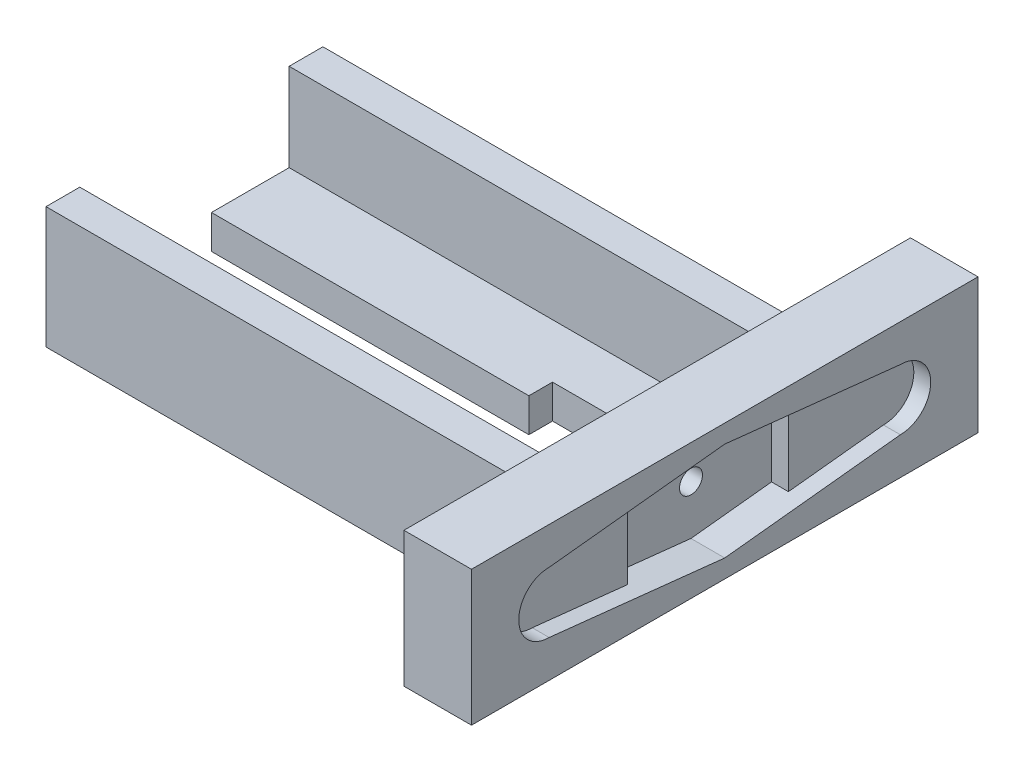
ISO-10303-21;
HEADER;
FILE_DESCRIPTION(('STEP AP214'),'2;1');
FILE_NAME('part.step','',(''),(''),'','','');
FILE_SCHEMA(('AUTOMOTIVE_DESIGN { 1 0 10303 214 1 1 1 1 }'));
ENDSEC;
DATA;
#1=APPLICATION_CONTEXT('core data for automotive mechanical design processes');
#2=APPLICATION_PROTOCOL_DEFINITION('international standard','automotive_design',2000,#1);
#3=PRODUCT_CONTEXT('',#1,'mechanical');
#4=PRODUCT('Part','Part','',(#3));
#5=PRODUCT_RELATED_PRODUCT_CATEGORY('part','',(#4));
#6=PRODUCT_DEFINITION_FORMATION('','',#4);
#7=PRODUCT_DEFINITION_CONTEXT('part definition',#1,'design');
#8=PRODUCT_DEFINITION('design','',#6,#7);
#9=PRODUCT_DEFINITION_SHAPE('','',#8);
#10=(LENGTH_UNIT() NAMED_UNIT(*) SI_UNIT(.MILLI.,.METRE.));
#11=(NAMED_UNIT(*) PLANE_ANGLE_UNIT() SI_UNIT($,.RADIAN.));
#12=(NAMED_UNIT(*) SI_UNIT($,.STERADIAN.) SOLID_ANGLE_UNIT());
#13=UNCERTAINTY_MEASURE_WITH_UNIT(LENGTH_MEASURE(1.E-05),#10,'distance_accuracy_value','');
#14=(GEOMETRIC_REPRESENTATION_CONTEXT(3) GLOBAL_UNCERTAINTY_ASSIGNED_CONTEXT((#13)) GLOBAL_UNIT_ASSIGNED_CONTEXT((#10,
#11,#12)) REPRESENTATION_CONTEXT('',''));
#15=CARTESIAN_POINT('',(0.,0.,0.));
#16=DIRECTION('',(0.,0.,1.));
#17=DIRECTION('',(1.,0.,0.));
#18=AXIS2_PLACEMENT_3D('',#15,#16,#17);
#19=CARTESIAN_POINT('',(0.,10.,-37.5));
#20=DIRECTION('',(-1.,0.,0.));
#21=DIRECTION('',(0.,0.,1.));
#22=AXIS2_PLACEMENT_3D('',#19,#20,#21);
#23=CYLINDRICAL_SURFACE('',#22,1.7);
#24=CARTESIAN_POINT('',(1.65,10.,-37.5));
#25=DIRECTION('',(-1.,0.,0.));
#26=DIRECTION('',(0.,0.,1.));
#27=AXIS2_PLACEMENT_3D('',#24,#25,#26);
#28=CIRCLE('',#27,1.7);
#29=CARTESIAN_POINT('',(1.65,10.,-35.8));
#30=VERTEX_POINT('',#29);
#31=EDGE_CURVE('E366',#30,#30,#28,.T.);
#32=ORIENTED_EDGE('',*,*,#31,.T.);
#33=EDGE_LOOP('',(#32));
#34=FACE_BOUND('',#33,.T.);
#35=CARTESIAN_POINT('',(5.,10.,-37.5));
#36=DIRECTION('',(1.,0.,0.));
#37=DIRECTION('',(0.,0.,-1.));
#38=AXIS2_PLACEMENT_3D('',#35,#36,#37);
#39=CIRCLE('',#38,1.7);
#40=CARTESIAN_POINT('',(5.,10.,-39.2));
#41=VERTEX_POINT('',#40);
#42=EDGE_CURVE('E44',#41,#41,#39,.F.);
#43=ORIENTED_EDGE('',*,*,#42,.F.);
#44=EDGE_LOOP('',(#43));
#45=FACE_BOUND('',#44,.T.);
#46=ADVANCED_FACE('F40',(#34,#45),#23,.F.);
#47=CARTESIAN_POINT('',(7.50000000000001,0.,0.));
#48=DIRECTION('',(1.,0.,0.));
#49=DIRECTION('',(0.,0.,-1.));
#50=AXIS2_PLACEMENT_3D('',#47,#48,#49);
#51=PLANE('',#50);
#52=DIRECTION('',(0.,1.,0.));
#53=VECTOR('',#52,1.);
#54=CARTESIAN_POINT('',(7.5,0.,-49.4310136830803));
#55=LINE('',#54,#53);
#56=CARTESIAN_POINT('',(7.5,3.98487839663942,-49.4310136830803));
#57=VERTEX_POINT('',#56);
#58=CARTESIAN_POINT('',(7.5,16.0151216033606,-49.4310136830803));
#59=VERTEX_POINT('',#58);
#60=EDGE_CURVE('E288',#57,#59,#55,.T.);
#61=ORIENTED_EDGE('',*,*,#60,.F.);
#62=DIRECTION('',(0.,-0.107073199719951,0.994251140256692));
#63=VECTOR('',#62,1.);
#64=CARTESIAN_POINT('',(7.50000000000001,-1.32311651848386,-0.142489471221339));
#65=LINE('',#64,#63);
#66=CARTESIAN_POINT('',(7.5,5.5,-63.5));
#67=VERTEX_POINT('',#66);
#68=EDGE_CURVE('E321',#67,#57,#65,.T.);
#69=ORIENTED_EDGE('',*,*,#68,.F.);
#70=CARTESIAN_POINT('',(7.5,10.,-63.5));
#71=DIRECTION('',(1.,0.,0.));
#72=DIRECTION('',(0.,0.,-1.));
#73=AXIS2_PLACEMENT_3D('',#70,#71,#72);
#74=CIRCLE('',#73,4.5);
#75=CARTESIAN_POINT('',(7.5,14.5,-63.5));
#76=VERTEX_POINT('',#75);
#77=EDGE_CURVE('E303',#76,#67,#74,.F.);
#78=ORIENTED_EDGE('',*,*,#77,.F.);
#79=DIRECTION('',(0.,-0.107073199719952,-0.994251140256692));
#80=VECTOR('',#79,1.);
#81=CARTESIAN_POINT('',(7.50000000000001,21.0938231165185,-2.27164248947123));
#82=LINE('',#81,#80);
#83=EDGE_CURVE('E307',#59,#76,#82,.T.);
#84=ORIENTED_EDGE('',*,*,#83,.F.);
#85=EDGE_LOOP('',(#61,#69,#78,#84));
#86=FACE_BOUND('',#85,.T.);
#87=ADVANCED_FACE('F576',(#86),#51,.T.);
#88=CARTESIAN_POINT('',(10.,20.,0.));
#89=DIRECTION('',(-1.,0.,0.));
#90=DIRECTION('',(0.,0.,1.));
#91=AXIS2_PLACEMENT_3D('',#88,#89,#90);
#92=PLANE('',#91);
#93=DIRECTION('',(0.,0.,-1.));
#94=VECTOR('',#93,1.);
#95=CARTESIAN_POINT('',(10.,0.,0.));
#96=LINE('',#95,#94);
#97=CARTESIAN_POINT('',(10.,0.,0.));
#98=VERTEX_POINT('',#97);
#99=CARTESIAN_POINT('',(10.,0.,-75.));
#100=VERTEX_POINT('',#99);
#101=EDGE_CURVE('E531',#98,#100,#96,.T.);
#102=ORIENTED_EDGE('',*,*,#101,.T.);
#103=DIRECTION('',(0.,-1.,0.));
#104=VECTOR('',#103,1.);
#105=CARTESIAN_POINT('',(10.,20.,-75.));
#106=LINE('',#105,#104);
#107=CARTESIAN_POINT('',(10.,20.,-75.));
#108=VERTEX_POINT('',#107);
#109=EDGE_CURVE('E545',#108,#100,#106,.T.);
#110=ORIENTED_EDGE('',*,*,#109,.F.);
#111=DIRECTION('',(0.,0.,-1.));
#112=VECTOR('',#111,1.);
#113=CARTESIAN_POINT('',(10.,20.,0.));
#114=LINE('',#113,#112);
#115=CARTESIAN_POINT('',(10.,20.,0.));
#116=VERTEX_POINT('',#115);
#117=EDGE_CURVE('E516',#116,#108,#114,.T.);
#118=ORIENTED_EDGE('',*,*,#117,.F.);
#119=DIRECTION('',(0.,-1.,0.));
#120=VECTOR('',#119,1.);
#121=CARTESIAN_POINT('',(10.,20.,0.));
#122=LINE('',#121,#120);
#123=EDGE_CURVE('E541',#116,#98,#122,.T.);
#124=ORIENTED_EDGE('',*,*,#123,.T.);
#125=EDGE_LOOP('',(#102,#110,#118,#124));
#126=FACE_BOUND('',#125,.T.);
#127=CARTESIAN_POINT('',(10.,10.,-63.5));
#128=DIRECTION('',(1.,0.,0.));
#129=DIRECTION('',(0.,0.,-1.));
#130=AXIS2_PLACEMENT_3D('',#127,#128,#129);
#131=CIRCLE('',#130,4.5);
#132=CARTESIAN_POINT('',(10.,14.5,-63.5));
#133=VERTEX_POINT('',#132);
#134=CARTESIAN_POINT('',(10.,5.5,-63.5));
#135=VERTEX_POINT('',#134);
#136=EDGE_CURVE('E325',#133,#135,#131,.F.);
#137=ORIENTED_EDGE('',*,*,#136,.T.);
#138=DIRECTION('',(0.,-0.107073199719951,0.994251140256692));
#139=VECTOR('',#138,1.);
#140=CARTESIAN_POINT('',(10.,-1.32311651848386,-0.14248947122134));
#141=LINE('',#140,#139);
#142=CARTESIAN_POINT('',(10.,2.7,-37.5));
#143=VERTEX_POINT('',#142);
#144=EDGE_CURVE('E308',#135,#143,#141,.T.);
#145=ORIENTED_EDGE('',*,*,#144,.T.);
#146=DIRECTION('',(0.,0.107073199719951,0.994251140256692));
#147=VECTOR('',#146,1.);
#148=CARTESIAN_POINT('',(10.,6.66120729995321,-0.717360786148809));
#149=LINE('',#148,#147);
#150=CARTESIAN_POINT('',(10.,5.5,-11.5));
#151=VERTEX_POINT('',#150);
#152=EDGE_CURVE('E337',#143,#151,#149,.T.);
#153=ORIENTED_EDGE('',*,*,#152,.T.);
#154=CARTESIAN_POINT('',(10.,10.,-11.5));
#155=DIRECTION('',(1.,0.,0.));
#156=DIRECTION('',(0.,0.,-1.));
#157=AXIS2_PLACEMENT_3D('',#154,#155,#156);
#158=CIRCLE('',#157,4.5);
#159=CARTESIAN_POINT('',(10.,14.5,-11.5));
#160=VERTEX_POINT('',#159);
#161=EDGE_CURVE('E333',#160,#151,#158,.T.);
#162=ORIENTED_EDGE('',*,*,#161,.F.);
#163=DIRECTION('',(0.,0.107073199719952,-0.994251140256692));
#164=VECTOR('',#163,1.);
#165=CARTESIAN_POINT('',(10.,13.1094992980814,1.41179223210108));
#166=LINE('',#165,#164);
#167=CARTESIAN_POINT('',(10.,17.3,-37.5));
#168=VERTEX_POINT('',#167);
#169=EDGE_CURVE('E330',#160,#168,#166,.T.);
#170=ORIENTED_EDGE('',*,*,#169,.T.);
#171=DIRECTION('',(0.,-0.107073199719952,-0.994251140256692));
#172=VECTOR('',#171,1.);
#173=CARTESIAN_POINT('',(10.,21.0938231165185,-2.27164248947123));
#174=LINE('',#173,#172);
#175=EDGE_CURVE('E57',#168,#133,#174,.T.);
#176=ORIENTED_EDGE('',*,*,#175,.T.);
#177=EDGE_LOOP('',(#137,#145,#153,#162,#170,#176));
#178=FACE_BOUND('',#177,.T.);
#179=ADVANCED_FACE('F582',(#126,#178),#92,.F.);
#180=CARTESIAN_POINT('',(-70.,-15.,-41.5));
#181=DIRECTION('',(0.,0.,-1.));
#182=DIRECTION('',(-1.,0.,0.));
#183=AXIS2_PLACEMENT_3D('',#180,#181,#182);
#184=PLANE('',#183);
#185=DIRECTION('',(1.,0.,0.));
#186=VECTOR('',#185,1.);
#187=CARTESIAN_POINT('',(0.,0.,-41.5));
#188=LINE('',#187,#186);
#189=CARTESIAN_POINT('',(-70.,0.,-41.5));
#190=VERTEX_POINT('',#189);
#191=CARTESIAN_POINT('',(-23.,0.,-41.5));
#192=VERTEX_POINT('',#191);
#193=EDGE_CURVE('E418',#190,#192,#188,.T.);
#194=ORIENTED_EDGE('',*,*,#193,.T.);
#195=DIRECTION('',(0.,1.,0.));
#196=VECTOR('',#195,1.);
#197=CARTESIAN_POINT('',(-23.,-15.,-41.5));
#198=LINE('',#197,#196);
#199=CARTESIAN_POINT('',(-23.,5.,-41.5));
#200=VERTEX_POINT('',#199);
#201=EDGE_CURVE('E11',#192,#200,#198,.T.);
#202=ORIENTED_EDGE('',*,*,#201,.T.);
#203=DIRECTION('',(-1.,0.,0.));
#204=VECTOR('',#203,1.);
#205=CARTESIAN_POINT('',(-70.,5.,-41.5));
#206=LINE('',#205,#204);
#207=CARTESIAN_POINT('',(-70.,5.,-41.5));
#208=VERTEX_POINT('',#207);
#209=EDGE_CURVE('E403',#200,#208,#206,.T.);
#210=ORIENTED_EDGE('',*,*,#209,.T.);
#211=DIRECTION('',(0.,-1.,0.));
#212=VECTOR('',#211,1.);
#213=CARTESIAN_POINT('',(-70.,0.,-41.5));
#214=LINE('',#213,#212);
#215=EDGE_CURVE('E553',#208,#190,#214,.T.);
#216=ORIENTED_EDGE('',*,*,#215,.T.);
#217=EDGE_LOOP('',(#194,#202,#210,#216));
#218=FACE_BOUND('',#217,.T.);
#219=ADVANCED_FACE('F606',(#218),#184,.F.);
#220=CARTESIAN_POINT('',(-70.,0.,0.));
#221=DIRECTION('',(-1.,0.,0.));
#222=DIRECTION('',(0.,0.,1.));
#223=AXIS2_PLACEMENT_3D('',#220,#221,#222);
#224=PLANE('',#223);
#225=ORIENTED_EDGE('',*,*,#215,.F.);
#226=DIRECTION('',(0.,0.,-1.));
#227=VECTOR('',#226,1.);
#228=CARTESIAN_POINT('',(-70.,5.,-53.));
#229=LINE('',#228,#227);
#230=CARTESIAN_POINT('',(-70.,5.,-53.));
#231=VERTEX_POINT('',#230);
#232=EDGE_CURVE('E490',#208,#231,#229,.T.);
#233=ORIENTED_EDGE('',*,*,#232,.T.);
#234=DIRECTION('',(0.,1.,0.));
#235=VECTOR('',#234,1.);
#236=CARTESIAN_POINT('',(-70.,0.,-53.));
#237=LINE('',#236,#235);
#238=CARTESIAN_POINT('',(-70.,18.,-53.));
#239=VERTEX_POINT('',#238);
#240=EDGE_CURVE('E426',#231,#239,#237,.T.);
#241=ORIENTED_EDGE('',*,*,#240,.T.);
#242=DIRECTION('',(0.,0.,-1.));
#243=VECTOR('',#242,1.);
#244=CARTESIAN_POINT('',(-70.,18.,-53.));
#245=LINE('',#244,#243);
#246=CARTESIAN_POINT('',(-70.,18.,-58.));
#247=VERTEX_POINT('',#246);
#248=EDGE_CURVE('E429',#239,#247,#245,.T.);
#249=ORIENTED_EDGE('',*,*,#248,.T.);
#250=DIRECTION('',(0.,-1.,0.));
#251=VECTOR('',#250,1.);
#252=CARTESIAN_POINT('',(-70.,0.,-58.));
#253=LINE('',#252,#251);
#254=CARTESIAN_POINT('',(-70.,0.,-58.));
#255=VERTEX_POINT('',#254);
#256=EDGE_CURVE('E433',#247,#255,#253,.T.);
#257=ORIENTED_EDGE('',*,*,#256,.T.);
#258=DIRECTION('',(0.,0.,1.));
#259=VECTOR('',#258,1.);
#260=CARTESIAN_POINT('',(-70.,0.,-53.));
#261=LINE('',#260,#259);
#262=EDGE_CURVE('E486',#255,#190,#261,.T.);
#263=ORIENTED_EDGE('',*,*,#262,.T.);
#264=EDGE_LOOP('',(#225,#233,#241,#249,#257,#263));
#265=FACE_BOUND('',#264,.T.);
#266=ADVANCED_FACE('F641',(#265),#224,.T.);
#267=CARTESIAN_POINT('',(0.,20.,0.));
#268=DIRECTION('',(-1.,0.,0.));
#269=DIRECTION('',(0.,0.,1.));
#270=AXIS2_PLACEMENT_3D('',#267,#268,#269);
#271=PLANE('',#270);
#272=CARTESIAN_POINT('',(0.,10.,-37.5));
#273=DIRECTION('',(-1.,0.,0.));
#274=DIRECTION('',(0.,0.,1.));
#275=AXIS2_PLACEMENT_3D('',#272,#273,#274);
#276=CIRCLE('',#275,3.35);
#277=CARTESIAN_POINT('',(0.,10.,-34.15));
#278=VERTEX_POINT('',#277);
#279=EDGE_CURVE('E346',#278,#278,#276,.T.);
#280=ORIENTED_EDGE('',*,*,#279,.F.);
#281=EDGE_LOOP('',(#280));
#282=FACE_BOUND('',#281,.T.);
#283=DIRECTION('',(0.,0.,-1.));
#284=VECTOR('',#283,1.);
#285=CARTESIAN_POINT('',(0.,18.,-53.));
#286=LINE('',#285,#284);
#287=CARTESIAN_POINT('',(0.,18.,-53.));
#288=VERTEX_POINT('',#287);
#289=CARTESIAN_POINT('',(0.,18.,-58.));
#290=VERTEX_POINT('',#289);
#291=EDGE_CURVE('E440',#288,#290,#286,.T.);
#292=ORIENTED_EDGE('',*,*,#291,.F.);
#293=DIRECTION('',(0.,1.,0.));
#294=VECTOR('',#293,1.);
#295=CARTESIAN_POINT('',(0.,0.,-53.));
#296=LINE('',#295,#294);
#297=CARTESIAN_POINT('',(0.,5.,-53.));
#298=VERTEX_POINT('',#297);
#299=EDGE_CURVE('E425',#298,#288,#296,.T.);
#300=ORIENTED_EDGE('',*,*,#299,.F.);
#301=DIRECTION('',(0.,0.,-1.));
#302=VECTOR('',#301,1.);
#303=CARTESIAN_POINT('',(0.,5.,-53.));
#304=LINE('',#303,#302);
#305=CARTESIAN_POINT('',(0.,5.,-22.));
#306=VERTEX_POINT('',#305);
#307=EDGE_CURVE('E485',#306,#298,#304,.T.);
#308=ORIENTED_EDGE('',*,*,#307,.F.);
#309=DIRECTION('',(0.,-1.,0.));
#310=VECTOR('',#309,1.);
#311=CARTESIAN_POINT('',(0.,0.,-22.));
#312=LINE('',#311,#310);
#313=CARTESIAN_POINT('',(0.,18.,-22.));
#314=VERTEX_POINT('',#313);
#315=EDGE_CURVE('E456',#314,#306,#312,.T.);
#316=ORIENTED_EDGE('',*,*,#315,.F.);
#317=DIRECTION('',(0.,0.,-1.));
#318=VECTOR('',#317,1.);
#319=CARTESIAN_POINT('',(0.,18.,-22.));
#320=LINE('',#319,#318);
#321=CARTESIAN_POINT('',(0.,18.,-17.));
#322=VERTEX_POINT('',#321);
#323=EDGE_CURVE('E461',#322,#314,#320,.T.);
#324=ORIENTED_EDGE('',*,*,#323,.F.);
#325=DIRECTION('',(0.,1.,0.));
#326=VECTOR('',#325,1.);
#327=CARTESIAN_POINT('',(0.,0.,-17.));
#328=LINE('',#327,#326);
#329=CARTESIAN_POINT('',(0.,0.,-17.));
#330=VERTEX_POINT('',#329);
#331=EDGE_CURVE('E470',#330,#322,#328,.T.);
#332=ORIENTED_EDGE('',*,*,#331,.F.);
#333=DIRECTION('',(0.,0.,-1.));
#334=VECTOR('',#333,1.);
#335=CARTESIAN_POINT('',(0.,0.,0.));
#336=LINE('',#335,#334);
#337=CARTESIAN_POINT('',(0.,0.,0.));
#338=VERTEX_POINT('',#337);
#339=EDGE_CURVE('E523',#338,#330,#336,.T.);
#340=ORIENTED_EDGE('',*,*,#339,.F.);
#341=DIRECTION('',(0.,-1.,0.));
#342=VECTOR('',#341,1.);
#343=CARTESIAN_POINT('',(0.,20.,0.));
#344=LINE('',#343,#342);
#345=CARTESIAN_POINT('',(0.,20.,0.));
#346=VERTEX_POINT('',#345);
#347=EDGE_CURVE('E537',#346,#338,#344,.T.);
#348=ORIENTED_EDGE('',*,*,#347,.F.);
#349=DIRECTION('',(0.,0.,-1.));
#350=VECTOR('',#349,1.);
#351=CARTESIAN_POINT('',(0.,20.,0.));
#352=LINE('',#351,#350);
#353=CARTESIAN_POINT('',(0.,20.,-75.));
#354=VERTEX_POINT('',#353);
#355=EDGE_CURVE('E507',#346,#354,#352,.T.);
#356=ORIENTED_EDGE('',*,*,#355,.T.);
#357=DIRECTION('',(0.,-1.,0.));
#358=VECTOR('',#357,1.);
#359=CARTESIAN_POINT('',(0.,20.,-75.));
#360=LINE('',#359,#358);
#361=CARTESIAN_POINT('',(0.,0.,-75.));
#362=VERTEX_POINT('',#361);
#363=EDGE_CURVE('E522',#354,#362,#360,.T.);
#364=ORIENTED_EDGE('',*,*,#363,.T.);
#365=CARTESIAN_POINT('',(0.,0.,-58.));
#366=VERTEX_POINT('',#365);
#367=EDGE_CURVE('E506',#366,#362,#336,.T.);
#368=ORIENTED_EDGE('',*,*,#367,.F.);
#369=DIRECTION('',(0.,-1.,0.));
#370=VECTOR('',#369,1.);
#371=CARTESIAN_POINT('',(0.,0.,-58.));
#372=LINE('',#371,#370);
#373=EDGE_CURVE('E430',#290,#366,#372,.T.);
#374=ORIENTED_EDGE('',*,*,#373,.F.);
#375=EDGE_LOOP('',(#292,#300,#308,#316,#324,#332,#340,#348,#356,#364,#368,#374));
#376=FACE_BOUND('',#375,.T.);
#377=ADVANCED_FACE('F42',(#282,#376),#271,.T.);
#378=CARTESIAN_POINT('',(0.,20.,0.));
#379=DIRECTION('',(0.,0.,-1.));
#380=DIRECTION('',(-1.,0.,0.));
#381=AXIS2_PLACEMENT_3D('',#378,#379,#380);
#382=PLANE('',#381);
#383=DIRECTION('',(1.,0.,0.));
#384=VECTOR('',#383,1.);
#385=CARTESIAN_POINT('',(0.,0.,0.));
#386=LINE('',#385,#384);
#387=EDGE_CURVE('E512',#338,#98,#386,.T.);
#388=ORIENTED_EDGE('',*,*,#387,.T.);
#389=ORIENTED_EDGE('',*,*,#123,.F.);
#390=DIRECTION('',(1.,0.,0.));
#391=VECTOR('',#390,1.);
#392=CARTESIAN_POINT('',(0.,20.,0.));
#393=LINE('',#392,#391);
#394=EDGE_CURVE('E519',#346,#116,#393,.T.);
#395=ORIENTED_EDGE('',*,*,#394,.F.);
#396=ORIENTED_EDGE('',*,*,#347,.T.);
#397=EDGE_LOOP('',(#388,#389,#395,#396));
#398=FACE_BOUND('',#397,.T.);
#399=ADVANCED_FACE('F652',(#398),#382,.F.);
#400=CARTESIAN_POINT('',(0.,20.,-75.));
#401=DIRECTION('',(0.,0.,-1.));
#402=DIRECTION('',(-1.,0.,0.));
#403=AXIS2_PLACEMENT_3D('',#400,#401,#402);
#404=PLANE('',#403);
#405=DIRECTION('',(1.,0.,0.));
#406=VECTOR('',#405,1.);
#407=CARTESIAN_POINT('',(0.,0.,-75.));
#408=LINE('',#407,#406);
#409=EDGE_CURVE('E527',#362,#100,#408,.T.);
#410=ORIENTED_EDGE('',*,*,#409,.F.);
#411=ORIENTED_EDGE('',*,*,#363,.F.);
#412=DIRECTION('',(1.,0.,0.));
#413=VECTOR('',#412,1.);
#414=CARTESIAN_POINT('',(0.,20.,-75.));
#415=LINE('',#414,#413);
#416=EDGE_CURVE('E511',#354,#108,#415,.T.);
#417=ORIENTED_EDGE('',*,*,#416,.T.);
#418=ORIENTED_EDGE('',*,*,#109,.T.);
#419=EDGE_LOOP('',(#410,#411,#417,#418));
#420=FACE_BOUND('',#419,.T.);
#421=ADVANCED_FACE('F648',(#420),#404,.T.);
#422=CARTESIAN_POINT('',(0.,20.,0.));
#423=DIRECTION('',(0.,-1.,0.));
#424=DIRECTION('',(0.,0.,-1.));
#425=AXIS2_PLACEMENT_3D('',#422,#423,#424);
#426=PLANE('',#425);
#427=ORIENTED_EDGE('',*,*,#355,.F.);
#428=ORIENTED_EDGE('',*,*,#394,.T.);
#429=ORIENTED_EDGE('',*,*,#117,.T.);
#430=ORIENTED_EDGE('',*,*,#416,.F.);
#431=EDGE_LOOP('',(#427,#428,#429,#430));
#432=FACE_BOUND('',#431,.T.);
#433=ADVANCED_FACE('F645',(#432),#426,.F.);
#434=CARTESIAN_POINT('',(0.,0.,0.));
#435=DIRECTION('',(0.,-1.,0.));
#436=DIRECTION('',(0.,0.,-1.));
#437=AXIS2_PLACEMENT_3D('',#434,#435,#436);
#438=PLANE('',#437);
#439=DIRECTION('',(0.,0.,-1.));
#440=VECTOR('',#439,1.);
#441=CARTESIAN_POINT('',(-23.,0.,0.));
#442=LINE('',#441,#440);
#443=CARTESIAN_POINT('',(-23.,0.,-45.));
#444=VERTEX_POINT('',#443);
#445=EDGE_CURVE('E389',#192,#444,#442,.T.);
#446=ORIENTED_EDGE('',*,*,#445,.F.);
#447=ORIENTED_EDGE('',*,*,#193,.F.);
#448=ORIENTED_EDGE('',*,*,#262,.F.);
#449=DIRECTION('',(1.,0.,0.));
#450=VECTOR('',#449,1.);
#451=CARTESIAN_POINT('',(-70.,0.,-58.));
#452=LINE('',#451,#450);
#453=EDGE_CURVE('E437',#255,#366,#452,.T.);
#454=ORIENTED_EDGE('',*,*,#453,.T.);
#455=ORIENTED_EDGE('',*,*,#367,.T.);
#456=ORIENTED_EDGE('',*,*,#409,.T.);
#457=ORIENTED_EDGE('',*,*,#101,.F.);
#458=ORIENTED_EDGE('',*,*,#387,.F.);
#459=ORIENTED_EDGE('',*,*,#339,.T.);
#460=DIRECTION('',(1.,0.,0.));
#461=VECTOR('',#460,1.);
#462=CARTESIAN_POINT('',(-70.,0.,-17.));
#463=LINE('',#462,#461);
#464=CARTESIAN_POINT('',(-70.,0.,-17.));
#465=VERTEX_POINT('',#464);
#466=EDGE_CURVE('E482',#465,#330,#463,.T.);
#467=ORIENTED_EDGE('',*,*,#466,.F.);
#468=CARTESIAN_POINT('',(-70.,0.,-33.5));
#469=VERTEX_POINT('',#468);
#470=EDGE_CURVE('E491',#469,#465,#261,.T.);
#471=ORIENTED_EDGE('',*,*,#470,.F.);
#472=DIRECTION('',(-1.,0.,0.));
#473=VECTOR('',#472,1.);
#474=CARTESIAN_POINT('',(0.,0.,-33.5));
#475=LINE('',#474,#473);
#476=CARTESIAN_POINT('',(-10.,0.,-33.5));
#477=VERTEX_POINT('',#476);
#478=EDGE_CURVE('E412',#477,#469,#475,.T.);
#479=ORIENTED_EDGE('',*,*,#478,.F.);
#480=DIRECTION('',(0.,0.,1.));
#481=VECTOR('',#480,1.);
#482=CARTESIAN_POINT('',(-10.,0.,0.));
#483=LINE('',#482,#481);
#484=CARTESIAN_POINT('',(-10.,0.,-41.5));
#485=VERTEX_POINT('',#484);
#486=EDGE_CURVE('E422',#485,#477,#483,.T.);
#487=ORIENTED_EDGE('',*,*,#486,.F.);
#488=CARTESIAN_POINT('',(-13.,0.,-41.5));
#489=VERTEX_POINT('',#488);
#490=EDGE_CURVE('E417',#489,#485,#188,.T.);
#491=ORIENTED_EDGE('',*,*,#490,.F.);
#492=DIRECTION('',(0.,0.,1.));
#493=VECTOR('',#492,1.);
#494=CARTESIAN_POINT('',(-13.,0.,0.));
#495=LINE('',#494,#493);
#496=CARTESIAN_POINT('',(-13.,0.,-45.));
#497=VERTEX_POINT('',#496);
#498=EDGE_CURVE('E65',#497,#489,#495,.T.);
#499=ORIENTED_EDGE('',*,*,#498,.F.);
#500=DIRECTION('',(1.,0.,0.));
#501=VECTOR('',#500,1.);
#502=CARTESIAN_POINT('',(0.,0.,-45.));
#503=LINE('',#502,#501);
#504=EDGE_CURVE('E392',#444,#497,#503,.T.);
#505=ORIENTED_EDGE('',*,*,#504,.F.);
#506=EDGE_LOOP('',(#446,#447,#448,#454,#455,#456,#457,#458,#459,#467,#471,#479,#487,#491,#499,#505));
#507=FACE_BOUND('',#506,.T.);
#508=ADVANCED_FACE('F566',(#507),#438,.T.);
#509=CARTESIAN_POINT('',(-70.,5.,-53.));
#510=DIRECTION('',(0.,-1.,0.));
#511=DIRECTION('',(0.,0.,-1.));
#512=AXIS2_PLACEMENT_3D('',#509,#510,#511);
#513=PLANE('',#512);
#514=ORIENTED_EDGE('',*,*,#209,.F.);
#515=DIRECTION('',(0.,0.,1.));
#516=VECTOR('',#515,1.);
#517=CARTESIAN_POINT('',(-23.,5.,-45.));
#518=LINE('',#517,#516);
#519=CARTESIAN_POINT('',(-23.,5.,-45.));
#520=VERTEX_POINT('',#519);
#521=EDGE_CURVE('E370',#520,#200,#518,.T.);
#522=ORIENTED_EDGE('',*,*,#521,.F.);
#523=DIRECTION('',(-1.,0.,0.));
#524=VECTOR('',#523,1.);
#525=CARTESIAN_POINT('',(-23.,5.,-45.));
#526=LINE('',#525,#524);
#527=CARTESIAN_POINT('',(-13.,5.,-45.));
#528=VERTEX_POINT('',#527);
#529=EDGE_CURVE('E377',#528,#520,#526,.T.);
#530=ORIENTED_EDGE('',*,*,#529,.F.);
#531=DIRECTION('',(0.,0.,-1.));
#532=VECTOR('',#531,1.);
#533=CARTESIAN_POINT('',(-13.,5.,-45.));
#534=LINE('',#533,#532);
#535=CARTESIAN_POINT('',(-13.,5.,-41.5));
#536=VERTEX_POINT('',#535);
#537=EDGE_CURVE('E373',#536,#528,#534,.T.);
#538=ORIENTED_EDGE('',*,*,#537,.F.);
#539=CARTESIAN_POINT('',(-10.,5.,-41.5));
#540=VERTEX_POINT('',#539);
#541=EDGE_CURVE('E404',#540,#536,#206,.T.);
#542=ORIENTED_EDGE('',*,*,#541,.F.);
#543=DIRECTION('',(0.,0.,-1.));
#544=VECTOR('',#543,1.);
#545=CARTESIAN_POINT('',(-10.,5.,-41.5));
#546=LINE('',#545,#544);
#547=CARTESIAN_POINT('',(-10.,5.,-33.5));
#548=VERTEX_POINT('',#547);
#549=EDGE_CURVE('E399',#548,#540,#546,.T.);
#550=ORIENTED_EDGE('',*,*,#549,.F.);
#551=DIRECTION('',(1.,0.,0.));
#552=VECTOR('',#551,1.);
#553=CARTESIAN_POINT('',(-70.,5.,-33.5));
#554=LINE('',#553,#552);
#555=CARTESIAN_POINT('',(-70.,5.,-33.5));
#556=VERTEX_POINT('',#555);
#557=EDGE_CURVE('E395',#556,#548,#554,.T.);
#558=ORIENTED_EDGE('',*,*,#557,.F.);
#559=CARTESIAN_POINT('',(-70.,5.,-22.));
#560=VERTEX_POINT('',#559);
#561=EDGE_CURVE('E492',#560,#556,#229,.T.);
#562=ORIENTED_EDGE('',*,*,#561,.F.);
#563=DIRECTION('',(1.,0.,0.));
#564=VECTOR('',#563,1.);
#565=CARTESIAN_POINT('',(-70.,5.,-22.));
#566=LINE('',#565,#564);
#567=EDGE_CURVE('E502',#560,#306,#566,.T.);
#568=ORIENTED_EDGE('',*,*,#567,.T.);
#569=ORIENTED_EDGE('',*,*,#307,.T.);
#570=DIRECTION('',(1.,0.,0.));
#571=VECTOR('',#570,1.);
#572=CARTESIAN_POINT('',(-70.,5.,-53.));
#573=LINE('',#572,#571);
#574=EDGE_CURVE('E496',#231,#298,#573,.T.);
#575=ORIENTED_EDGE('',*,*,#574,.F.);
#576=ORIENTED_EDGE('',*,*,#232,.F.);
#577=EDGE_LOOP('',(#514,#522,#530,#538,#542,#550,#558,#562,#568,#569,#575,#576));
#578=FACE_BOUND('',#577,.T.);
#579=ADVANCED_FACE('F639',(#578),#513,.F.);
#580=DIRECTION('',(0.,1.,0.));
#581=VECTOR('',#580,1.);
#582=CARTESIAN_POINT('',(-70.,0.,-33.5));
#583=LINE('',#582,#581);
#584=EDGE_CURVE('E540',#469,#556,#583,.T.);
#585=ORIENTED_EDGE('',*,*,#584,.F.);
#586=ORIENTED_EDGE('',*,*,#470,.T.);
#587=DIRECTION('',(0.,1.,0.));
#588=VECTOR('',#587,1.);
#589=CARTESIAN_POINT('',(-70.,0.,-17.));
#590=LINE('',#589,#588);
#591=CARTESIAN_POINT('',(-70.,18.,-17.));
#592=VERTEX_POINT('',#591);
#593=EDGE_CURVE('E460',#465,#592,#590,.T.);
#594=ORIENTED_EDGE('',*,*,#593,.T.);
#595=DIRECTION('',(0.,0.,-1.));
#596=VECTOR('',#595,1.);
#597=CARTESIAN_POINT('',(-70.,18.,-22.));
#598=LINE('',#597,#596);
#599=CARTESIAN_POINT('',(-70.,18.,-22.));
#600=VERTEX_POINT('',#599);
#601=EDGE_CURVE('E464',#592,#600,#598,.T.);
#602=ORIENTED_EDGE('',*,*,#601,.T.);
#603=DIRECTION('',(0.,-1.,0.));
#604=VECTOR('',#603,1.);
#605=CARTESIAN_POINT('',(-70.,0.,-22.));
#606=LINE('',#605,#604);
#607=EDGE_CURVE('E457',#600,#560,#606,.T.);
#608=ORIENTED_EDGE('',*,*,#607,.T.);
#609=ORIENTED_EDGE('',*,*,#561,.T.);
#610=EDGE_LOOP('',(#585,#586,#594,#602,#608,#609));
#611=FACE_BOUND('',#610,.T.);
#612=ADVANCED_FACE('F635',(#611),#224,.T.);
#613=CARTESIAN_POINT('',(-70.,0.,-22.));
#614=DIRECTION('',(0.,0.,1.));
#615=DIRECTION('',(1.,0.,0.));
#616=AXIS2_PLACEMENT_3D('',#613,#614,#615);
#617=PLANE('',#616);
#618=ORIENTED_EDGE('',*,*,#315,.T.);
#619=ORIENTED_EDGE('',*,*,#567,.F.);
#620=ORIENTED_EDGE('',*,*,#607,.F.);
#621=DIRECTION('',(1.,0.,0.));
#622=VECTOR('',#621,1.);
#623=CARTESIAN_POINT('',(-70.,18.,-22.));
#624=LINE('',#623,#622);
#625=EDGE_CURVE('E467',#600,#314,#624,.T.);
#626=ORIENTED_EDGE('',*,*,#625,.T.);
#627=EDGE_LOOP('',(#618,#619,#620,#626));
#628=FACE_BOUND('',#627,.T.);
#629=ADVANCED_FACE('F631',(#628),#617,.F.);
#630=CARTESIAN_POINT('',(-70.,0.,-17.));
#631=DIRECTION('',(0.,0.,-1.));
#632=DIRECTION('',(-1.,0.,0.));
#633=AXIS2_PLACEMENT_3D('',#630,#631,#632);
#634=PLANE('',#633);
#635=ORIENTED_EDGE('',*,*,#331,.T.);
#636=DIRECTION('',(1.,0.,0.));
#637=VECTOR('',#636,1.);
#638=CARTESIAN_POINT('',(-70.,18.,-17.));
#639=LINE('',#638,#637);
#640=EDGE_CURVE('E478',#592,#322,#639,.T.);
#641=ORIENTED_EDGE('',*,*,#640,.F.);
#642=ORIENTED_EDGE('',*,*,#593,.F.);
#643=ORIENTED_EDGE('',*,*,#466,.T.);
#644=EDGE_LOOP('',(#635,#641,#642,#643));
#645=FACE_BOUND('',#644,.T.);
#646=ADVANCED_FACE('F627',(#645),#634,.F.);
#647=CARTESIAN_POINT('',(-70.,18.,-22.));
#648=DIRECTION('',(0.,-1.,0.));
#649=DIRECTION('',(0.,0.,-1.));
#650=AXIS2_PLACEMENT_3D('',#647,#648,#649);
#651=PLANE('',#650);
#652=ORIENTED_EDGE('',*,*,#323,.T.);
#653=ORIENTED_EDGE('',*,*,#625,.F.);
#654=ORIENTED_EDGE('',*,*,#601,.F.);
#655=ORIENTED_EDGE('',*,*,#640,.T.);
#656=EDGE_LOOP('',(#652,#653,#654,#655));
#657=FACE_BOUND('',#656,.T.);
#658=ADVANCED_FACE('F623',(#657),#651,.F.);
#659=CARTESIAN_POINT('',(-70.,0.,-53.));
#660=DIRECTION('',(0.,0.,-1.));
#661=DIRECTION('',(-1.,0.,0.));
#662=AXIS2_PLACEMENT_3D('',#659,#660,#661);
#663=PLANE('',#662);
#664=ORIENTED_EDGE('',*,*,#240,.F.);
#665=ORIENTED_EDGE('',*,*,#574,.T.);
#666=ORIENTED_EDGE('',*,*,#299,.T.);
#667=DIRECTION('',(1.,0.,0.));
#668=VECTOR('',#667,1.);
#669=CARTESIAN_POINT('',(-70.,18.,-53.));
#670=LINE('',#669,#668);
#671=EDGE_CURVE('E452',#239,#288,#670,.T.);
#672=ORIENTED_EDGE('',*,*,#671,.F.);
#673=EDGE_LOOP('',(#664,#665,#666,#672));
#674=FACE_BOUND('',#673,.T.);
#675=ADVANCED_FACE('F619',(#674),#663,.F.);
#676=CARTESIAN_POINT('',(-70.,18.,-53.));
#677=DIRECTION('',(0.,-1.,0.));
#678=DIRECTION('',(0.,0.,-1.));
#679=AXIS2_PLACEMENT_3D('',#676,#677,#678);
#680=PLANE('',#679);
#681=ORIENTED_EDGE('',*,*,#291,.T.);
#682=DIRECTION('',(1.,0.,0.));
#683=VECTOR('',#682,1.);
#684=CARTESIAN_POINT('',(-70.,18.,-58.));
#685=LINE('',#684,#683);
#686=EDGE_CURVE('E448',#247,#290,#685,.T.);
#687=ORIENTED_EDGE('',*,*,#686,.F.);
#688=ORIENTED_EDGE('',*,*,#248,.F.);
#689=ORIENTED_EDGE('',*,*,#671,.T.);
#690=EDGE_LOOP('',(#681,#687,#688,#689));
#691=FACE_BOUND('',#690,.T.);
#692=ADVANCED_FACE('F615',(#691),#680,.F.);
#693=CARTESIAN_POINT('',(-70.,0.,-58.));
#694=DIRECTION('',(0.,0.,1.));
#695=DIRECTION('',(1.,0.,0.));
#696=AXIS2_PLACEMENT_3D('',#693,#694,#695);
#697=PLANE('',#696);
#698=ORIENTED_EDGE('',*,*,#373,.T.);
#699=ORIENTED_EDGE('',*,*,#453,.F.);
#700=ORIENTED_EDGE('',*,*,#256,.F.);
#701=ORIENTED_EDGE('',*,*,#686,.T.);
#702=EDGE_LOOP('',(#698,#699,#700,#701));
#703=FACE_BOUND('',#702,.T.);
#704=ADVANCED_FACE('F605',(#703),#697,.F.);
#705=ORIENTED_EDGE('',*,*,#541,.T.);
#706=DIRECTION('',(0.,-1.,0.));
#707=VECTOR('',#706,1.);
#708=CARTESIAN_POINT('',(-13.,-15.,-41.5));
#709=LINE('',#708,#707);
#710=EDGE_CURVE('E50',#536,#489,#709,.T.);
#711=ORIENTED_EDGE('',*,*,#710,.T.);
#712=ORIENTED_EDGE('',*,*,#490,.T.);
#713=DIRECTION('',(0.,1.,0.));
#714=VECTOR('',#713,1.);
#715=CARTESIAN_POINT('',(-10.,-15.,-41.5));
#716=LINE('',#715,#714);
#717=EDGE_CURVE('E409',#485,#540,#716,.T.);
#718=ORIENTED_EDGE('',*,*,#717,.T.);
#719=EDGE_LOOP('',(#705,#711,#712,#718));
#720=FACE_BOUND('',#719,.T.);
#721=ADVANCED_FACE('F559',(#720),#184,.F.);
#722=CARTESIAN_POINT('',(-10.,-15.,-41.5));
#723=DIRECTION('',(1.,0.,0.));
#724=DIRECTION('',(0.,0.,-1.));
#725=AXIS2_PLACEMENT_3D('',#722,#723,#724);
#726=PLANE('',#725);
#727=ORIENTED_EDGE('',*,*,#486,.T.);
#728=DIRECTION('',(0.,1.,0.));
#729=VECTOR('',#728,1.);
#730=CARTESIAN_POINT('',(-10.,-15.,-33.5));
#731=LINE('',#730,#729);
#732=EDGE_CURVE('E408',#477,#548,#731,.T.);
#733=ORIENTED_EDGE('',*,*,#732,.T.);
#734=ORIENTED_EDGE('',*,*,#549,.T.);
#735=ORIENTED_EDGE('',*,*,#717,.F.);
#736=EDGE_LOOP('',(#727,#733,#734,#735));
#737=FACE_BOUND('',#736,.T.);
#738=ADVANCED_FACE('F604',(#737),#726,.F.);
#739=CARTESIAN_POINT('',(-70.,-15.,-33.5));
#740=DIRECTION('',(0.,0.,1.));
#741=DIRECTION('',(1.,0.,0.));
#742=AXIS2_PLACEMENT_3D('',#739,#740,#741);
#743=PLANE('',#742);
#744=ORIENTED_EDGE('',*,*,#478,.T.);
#745=ORIENTED_EDGE('',*,*,#584,.T.);
#746=ORIENTED_EDGE('',*,*,#557,.T.);
#747=ORIENTED_EDGE('',*,*,#732,.F.);
#748=EDGE_LOOP('',(#744,#745,#746,#747));
#749=FACE_BOUND('',#748,.T.);
#750=ADVANCED_FACE('F600',(#749),#743,.F.);
#751=CARTESIAN_POINT('',(-23.,-15.,-45.));
#752=DIRECTION('',(-1.,0.,0.));
#753=DIRECTION('',(0.,0.,1.));
#754=AXIS2_PLACEMENT_3D('',#751,#752,#753);
#755=PLANE('',#754);
#756=ORIENTED_EDGE('',*,*,#445,.T.);
#757=DIRECTION('',(0.,1.,0.));
#758=VECTOR('',#757,1.);
#759=CARTESIAN_POINT('',(-23.,-15.,-45.));
#760=LINE('',#759,#758);
#761=EDGE_CURVE('E382',#444,#520,#760,.T.);
#762=ORIENTED_EDGE('',*,*,#761,.T.);
#763=ORIENTED_EDGE('',*,*,#521,.T.);
#764=ORIENTED_EDGE('',*,*,#201,.F.);
#765=EDGE_LOOP('',(#756,#762,#763,#764));
#766=FACE_BOUND('',#765,.T.);
#767=ADVANCED_FACE('F594',(#766),#755,.F.);
#768=CARTESIAN_POINT('',(-23.,-15.,-45.));
#769=DIRECTION('',(0.,0.,-1.));
#770=DIRECTION('',(-1.,0.,0.));
#771=AXIS2_PLACEMENT_3D('',#768,#769,#770);
#772=PLANE('',#771);
#773=ORIENTED_EDGE('',*,*,#504,.T.);
#774=DIRECTION('',(0.,1.,0.));
#775=VECTOR('',#774,1.);
#776=CARTESIAN_POINT('',(-13.,-15.,-45.));
#777=LINE('',#776,#775);
#778=EDGE_CURVE('E381',#497,#528,#777,.T.);
#779=ORIENTED_EDGE('',*,*,#778,.T.);
#780=ORIENTED_EDGE('',*,*,#529,.T.);
#781=ORIENTED_EDGE('',*,*,#761,.F.);
#782=EDGE_LOOP('',(#773,#779,#780,#781));
#783=FACE_BOUND('',#782,.T.);
#784=ADVANCED_FACE('F590',(#783),#772,.F.);
#785=CARTESIAN_POINT('',(-13.,-15.,-45.));
#786=DIRECTION('',(1.,0.,0.));
#787=DIRECTION('',(0.,0.,-1.));
#788=AXIS2_PLACEMENT_3D('',#785,#786,#787);
#789=PLANE('',#788);
#790=ORIENTED_EDGE('',*,*,#498,.T.);
#791=ORIENTED_EDGE('',*,*,#710,.F.);
#792=ORIENTED_EDGE('',*,*,#537,.T.);
#793=ORIENTED_EDGE('',*,*,#778,.F.);
#794=EDGE_LOOP('',(#790,#791,#792,#793));
#795=FACE_BOUND('',#794,.T.);
#796=ADVANCED_FACE('F593',(#795),#789,.F.);
#797=CARTESIAN_POINT('',(1.65,11.7,-37.5));
#798=DIRECTION('',(1.,0.,0.));
#799=DIRECTION('',(0.,0.,-1.));
#800=AXIS2_PLACEMENT_3D('',#797,#798,#799);
#801=PLANE('',#800);
#802=ORIENTED_EDGE('',*,*,#31,.F.);
#803=EDGE_LOOP('',(#802));
#804=FACE_BOUND('',#803,.T.);
#805=CARTESIAN_POINT('',(1.65,10.,-37.5));
#806=DIRECTION('',(-1.,0.,0.));
#807=DIRECTION('',(0.,0.,1.));
#808=AXIS2_PLACEMENT_3D('',#805,#806,#807);
#809=CIRCLE('',#808,3.35);
#810=CARTESIAN_POINT('',(1.65,10.,-34.15));
#811=VERTEX_POINT('',#810);
#812=EDGE_CURVE('E362',#811,#811,#809,.T.);
#813=ORIENTED_EDGE('',*,*,#812,.T.);
#814=EDGE_LOOP('',(#813));
#815=FACE_BOUND('',#814,.T.);
#816=ADVANCED_FACE('F588',(#804,#815),#801,.F.);
#817=CARTESIAN_POINT('',(0.,10.,-37.5));
#818=DIRECTION('',(-1.,0.,0.));
#819=DIRECTION('',(0.,0.,1.));
#820=AXIS2_PLACEMENT_3D('',#817,#818,#819);
#821=CYLINDRICAL_SURFACE('',#820,3.35);
#822=ORIENTED_EDGE('',*,*,#812,.F.);
#823=EDGE_LOOP('',(#822));
#824=FACE_BOUND('',#823,.T.);
#825=ORIENTED_EDGE('',*,*,#279,.T.);
#826=EDGE_LOOP('',(#825));
#827=FACE_BOUND('',#826,.T.);
#828=ADVANCED_FACE('F725',(#824,#827),#821,.F.);
#829=DIRECTION('',(0.,-1.,0.));
#830=VECTOR('',#829,1.);
#831=CARTESIAN_POINT('',(7.50000000000001,0.,-25.5689863169197));
#832=LINE('',#831,#830);
#833=CARTESIAN_POINT('',(7.5,16.0151216033606,-25.5689863169197));
#834=VERTEX_POINT('',#833);
#835=CARTESIAN_POINT('',(7.50000000000001,3.98487839663942,-25.5689863169197));
#836=VERTEX_POINT('',#835);
#837=EDGE_CURVE('E300',#834,#836,#832,.T.);
#838=ORIENTED_EDGE('',*,*,#837,.F.);
#839=DIRECTION('',(0.,0.107073199719952,-0.994251140256692));
#840=VECTOR('',#839,1.);
#841=CARTESIAN_POINT('',(7.50000000000001,13.1094992980814,1.41179223210108));
#842=LINE('',#841,#840);
#843=CARTESIAN_POINT('',(7.50000000000001,14.5,-11.5));
#844=VERTEX_POINT('',#843);
#845=EDGE_CURVE('E311',#844,#834,#842,.T.);
#846=ORIENTED_EDGE('',*,*,#845,.F.);
#847=CARTESIAN_POINT('',(7.50000000000001,10.,-11.5));
#848=DIRECTION('',(1.,0.,0.));
#849=DIRECTION('',(0.,0.,-1.));
#850=AXIS2_PLACEMENT_3D('',#847,#848,#849);
#851=CIRCLE('',#850,4.5);
#852=CARTESIAN_POINT('',(7.50000000000001,5.5,-11.5));
#853=VERTEX_POINT('',#852);
#854=EDGE_CURVE('E314',#844,#853,#851,.T.);
#855=ORIENTED_EDGE('',*,*,#854,.T.);
#856=DIRECTION('',(0.,0.107073199719951,0.994251140256692));
#857=VECTOR('',#856,1.);
#858=CARTESIAN_POINT('',(7.50000000000001,6.66120729995321,-0.717360786148808));
#859=LINE('',#858,#857);
#860=EDGE_CURVE('E318',#836,#853,#859,.T.);
#861=ORIENTED_EDGE('',*,*,#860,.F.);
#862=EDGE_LOOP('',(#838,#846,#855,#861));
#863=FACE_BOUND('',#862,.T.);
#864=ADVANCED_FACE('F585',(#863),#51,.T.);
#865=CARTESIAN_POINT('',(7.5,10.,-63.5));
#866=DIRECTION('',(1.,0.,0.));
#867=DIRECTION('',(0.,0.,-1.));
#868=AXIS2_PLACEMENT_3D('',#865,#866,#867);
#869=CYLINDRICAL_SURFACE('',#868,4.5);
#870=ORIENTED_EDGE('',*,*,#136,.F.);
#871=DIRECTION('',(1.,0.,0.));
#872=VECTOR('',#871,1.);
#873=CARTESIAN_POINT('',(7.5,14.5,-63.5));
#874=LINE('',#873,#872);
#875=EDGE_CURVE('E253',#76,#133,#874,.T.);
#876=ORIENTED_EDGE('',*,*,#875,.F.);
#877=ORIENTED_EDGE('',*,*,#77,.T.);
#878=DIRECTION('',(1.,0.,0.));
#879=VECTOR('',#878,1.);
#880=CARTESIAN_POINT('',(7.5,5.5,-63.5));
#881=LINE('',#880,#879);
#882=EDGE_CURVE('E342',#67,#135,#881,.T.);
#883=ORIENTED_EDGE('',*,*,#882,.T.);
#884=EDGE_LOOP('',(#870,#876,#877,#883));
#885=FACE_BOUND('',#884,.T.);
#886=ADVANCED_FACE('F732',(#885),#869,.F.);
#887=CARTESIAN_POINT('',(7.50000000000001,-1.32311651848386,-0.142489471221339));
#888=DIRECTION('',(0.,0.994251140256692,0.107073199719951));
#889=DIRECTION('',(0.,-0.107073199719951,0.994251140256692));
#890=AXIS2_PLACEMENT_3D('',#887,#888,#889);
#891=PLANE('',#890);
#892=ORIENTED_EDGE('',*,*,#68,.T.);
#893=DIRECTION('',(1.,0.,0.));
#894=VECTOR('',#893,1.);
#895=CARTESIAN_POINT('',(5.,3.98487839663942,-49.4310136830803));
#896=LINE('',#895,#894);
#897=CARTESIAN_POINT('',(5.,3.98487839663942,-49.4310136830803));
#898=VERTEX_POINT('',#897);
#899=EDGE_CURVE('E289',#898,#57,#896,.T.);
#900=ORIENTED_EDGE('',*,*,#899,.F.);
#901=DIRECTION('',(0.,0.107073199719952,-0.994251140256692));
#902=VECTOR('',#901,1.);
#903=CARTESIAN_POINT('',(5.00000000000001,2.7,-37.5));
#904=LINE('',#903,#902);
#905=CARTESIAN_POINT('',(5.00000000000001,2.7,-37.5));
#906=VERTEX_POINT('',#905);
#907=EDGE_CURVE('E280',#906,#898,#904,.T.);
#908=ORIENTED_EDGE('',*,*,#907,.F.);
#909=DIRECTION('',(1.,0.,0.));
#910=VECTOR('',#909,1.);
#911=CARTESIAN_POINT('',(7.50000000000001,2.7,-37.5));
#912=LINE('',#911,#910);
#913=EDGE_CURVE('E347',#906,#143,#912,.T.);
#914=ORIENTED_EDGE('',*,*,#913,.T.);
#915=ORIENTED_EDGE('',*,*,#144,.F.);
#916=ORIENTED_EDGE('',*,*,#882,.F.);
#917=EDGE_LOOP('',(#892,#900,#908,#914,#915,#916));
#918=FACE_BOUND('',#917,.T.);
#919=ADVANCED_FACE('F739',(#918),#891,.T.);
#920=CARTESIAN_POINT('',(7.50000000000001,6.66120729995321,-0.717360786148808));
#921=DIRECTION('',(0.,0.994251140256692,-0.107073199719951));
#922=DIRECTION('',(0.,0.107073199719951,0.994251140256692));
#923=AXIS2_PLACEMENT_3D('',#920,#921,#922);
#924=PLANE('',#923);
#925=DIRECTION('',(1.,0.,0.));
#926=VECTOR('',#925,1.);
#927=CARTESIAN_POINT('',(7.50000000000001,5.5,-11.5));
#928=LINE('',#927,#926);
#929=EDGE_CURVE('E351',#853,#151,#928,.T.);
#930=ORIENTED_EDGE('',*,*,#929,.T.);
#931=ORIENTED_EDGE('',*,*,#152,.F.);
#932=ORIENTED_EDGE('',*,*,#913,.F.);
#933=DIRECTION('',(0.,-0.107073199719951,-0.994251140256692));
#934=VECTOR('',#933,1.);
#935=CARTESIAN_POINT('',(5.00000000000001,3.98487839663942,-25.5689863169197));
#936=LINE('',#935,#934);
#937=CARTESIAN_POINT('',(5.00000000000001,3.98487839663942,-25.5689863169197));
#938=VERTEX_POINT('',#937);
#939=EDGE_CURVE('E276',#938,#906,#936,.T.);
#940=ORIENTED_EDGE('',*,*,#939,.F.);
#941=DIRECTION('',(1.,0.,0.));
#942=VECTOR('',#941,1.);
#943=CARTESIAN_POINT('',(5.00000000000001,3.98487839663942,-25.5689863169197));
#944=LINE('',#943,#942);
#945=EDGE_CURVE('E292',#938,#836,#944,.T.);
#946=ORIENTED_EDGE('',*,*,#945,.T.);
#947=ORIENTED_EDGE('',*,*,#860,.T.);
#948=EDGE_LOOP('',(#930,#931,#932,#940,#946,#947));
#949=FACE_BOUND('',#948,.T.);
#950=ADVANCED_FACE('F748',(#949),#924,.T.);
#951=CARTESIAN_POINT('',(7.50000000000001,10.,-11.5));
#952=DIRECTION('',(1.,0.,0.));
#953=DIRECTION('',(0.,0.,-1.));
#954=AXIS2_PLACEMENT_3D('',#951,#952,#953);
#955=CYLINDRICAL_SURFACE('',#954,4.5);
#956=ORIENTED_EDGE('',*,*,#161,.T.);
#957=ORIENTED_EDGE('',*,*,#929,.F.);
#958=ORIENTED_EDGE('',*,*,#854,.F.);
#959=DIRECTION('',(1.,0.,0.));
#960=VECTOR('',#959,1.);
#961=CARTESIAN_POINT('',(7.50000000000001,14.5,-11.5));
#962=LINE('',#961,#960);
#963=EDGE_CURVE('E252',#844,#160,#962,.T.);
#964=ORIENTED_EDGE('',*,*,#963,.T.);
#965=EDGE_LOOP('',(#956,#957,#958,#964));
#966=FACE_BOUND('',#965,.T.);
#967=ADVANCED_FACE('F745',(#966),#955,.F.);
#968=CARTESIAN_POINT('',(7.50000000000001,13.1094992980814,1.41179223210108));
#969=DIRECTION('',(0.,-0.994251140256692,-0.107073199719952));
#970=DIRECTION('',(0.,0.107073199719952,-0.994251140256692));
#971=AXIS2_PLACEMENT_3D('',#968,#969,#970);
#972=PLANE('',#971);
#973=ORIENTED_EDGE('',*,*,#845,.T.);
#974=DIRECTION('',(1.,0.,0.));
#975=VECTOR('',#974,1.);
#976=CARTESIAN_POINT('',(5.00000000000001,16.0151216033606,-25.5689863169197));
#977=LINE('',#976,#975);
#978=CARTESIAN_POINT('',(5.00000000000001,16.0151216033606,-25.5689863169197));
#979=VERTEX_POINT('',#978);
#980=EDGE_CURVE('E259',#979,#834,#977,.T.);
#981=ORIENTED_EDGE('',*,*,#980,.F.);
#982=DIRECTION('',(0.,-0.107073199719952,0.994251140256691));
#983=VECTOR('',#982,1.);
#984=CARTESIAN_POINT('',(5.00000000000001,17.3,-37.5));
#985=LINE('',#984,#983);
#986=CARTESIAN_POINT('',(5.00000000000001,17.3,-37.5));
#987=VERTEX_POINT('',#986);
#988=EDGE_CURVE('E256',#987,#979,#985,.T.);
#989=ORIENTED_EDGE('',*,*,#988,.F.);
#990=DIRECTION('',(1.,0.,0.));
#991=VECTOR('',#990,1.);
#992=CARTESIAN_POINT('',(7.5,17.3,-37.5));
#993=LINE('',#992,#991);
#994=EDGE_CURVE('E241',#987,#168,#993,.T.);
#995=ORIENTED_EDGE('',*,*,#994,.T.);
#996=ORIENTED_EDGE('',*,*,#169,.F.);
#997=ORIENTED_EDGE('',*,*,#963,.F.);
#998=EDGE_LOOP('',(#973,#981,#989,#995,#996,#997));
#999=FACE_BOUND('',#998,.T.);
#1000=ADVANCED_FACE('F258',(#999),#972,.T.);
#1001=CARTESIAN_POINT('',(7.50000000000001,21.0938231165185,-2.27164248947123));
#1002=DIRECTION('',(0.,-0.994251140256692,0.107073199719952));
#1003=DIRECTION('',(0.,-0.107073199719952,-0.994251140256692));
#1004=AXIS2_PLACEMENT_3D('',#1001,#1002,#1003);
#1005=PLANE('',#1004);
#1006=ORIENTED_EDGE('',*,*,#875,.T.);
#1007=ORIENTED_EDGE('',*,*,#175,.F.);
#1008=ORIENTED_EDGE('',*,*,#994,.F.);
#1009=DIRECTION('',(0.,0.107073199719952,0.994251140256691));
#1010=VECTOR('',#1009,1.);
#1011=CARTESIAN_POINT('',(5.,16.0151216033606,-49.4310136830803));
#1012=LINE('',#1011,#1010);
#1013=CARTESIAN_POINT('',(5.,16.0151216033606,-49.4310136830803));
#1014=VERTEX_POINT('',#1013);
#1015=EDGE_CURVE('E247',#1014,#987,#1012,.T.);
#1016=ORIENTED_EDGE('',*,*,#1015,.F.);
#1017=DIRECTION('',(1.,0.,0.));
#1018=VECTOR('',#1017,1.);
#1019=CARTESIAN_POINT('',(5.,16.0151216033606,-49.4310136830803));
#1020=LINE('',#1019,#1018);
#1021=EDGE_CURVE('E285',#1014,#59,#1020,.T.);
#1022=ORIENTED_EDGE('',*,*,#1021,.T.);
#1023=ORIENTED_EDGE('',*,*,#83,.T.);
#1024=EDGE_LOOP('',(#1006,#1007,#1008,#1016,#1022,#1023));
#1025=FACE_BOUND('',#1024,.T.);
#1026=ADVANCED_FACE('F244',(#1025),#1005,.T.);
#1027=CARTESIAN_POINT('',(5.00000000000001,0.,0.));
#1028=DIRECTION('',(1.,0.,0.));
#1029=DIRECTION('',(0.,0.,-1.));
#1030=AXIS2_PLACEMENT_3D('',#1027,#1028,#1029);
#1031=PLANE('',#1030);
#1032=ORIENTED_EDGE('',*,*,#1015,.T.);
#1033=ORIENTED_EDGE('',*,*,#988,.T.);
#1034=DIRECTION('',(0.,-1.,0.));
#1035=VECTOR('',#1034,1.);
#1036=CARTESIAN_POINT('',(5.00000000000001,16.0151216033606,-25.5689863169197));
#1037=LINE('',#1036,#1035);
#1038=EDGE_CURVE('E264',#979,#938,#1037,.T.);
#1039=ORIENTED_EDGE('',*,*,#1038,.T.);
#1040=ORIENTED_EDGE('',*,*,#939,.T.);
#1041=ORIENTED_EDGE('',*,*,#907,.T.);
#1042=DIRECTION('',(0.,1.,0.));
#1043=VECTOR('',#1042,1.);
#1044=CARTESIAN_POINT('',(5.,3.98487839663942,-49.4310136830803));
#1045=LINE('',#1044,#1043);
#1046=EDGE_CURVE('E270',#898,#1014,#1045,.T.);
#1047=ORIENTED_EDGE('',*,*,#1046,.T.);
#1048=EDGE_LOOP('',(#1032,#1033,#1039,#1040,#1041,#1047));
#1049=FACE_BOUND('',#1048,.T.);
#1050=ORIENTED_EDGE('',*,*,#42,.T.);
#1051=EDGE_LOOP('',(#1050));
#1052=FACE_BOUND('',#1051,.T.);
#1053=ADVANCED_FACE('F266',(#1049,#1052),#1031,.T.);
#1054=CARTESIAN_POINT('',(5.,3.98487839663942,-49.4310136830803));
#1055=DIRECTION('',(0.,0.,-1.));
#1056=DIRECTION('',(-1.,0.,0.));
#1057=AXIS2_PLACEMENT_3D('',#1054,#1055,#1056);
#1058=PLANE('',#1057);
#1059=ORIENTED_EDGE('',*,*,#60,.T.);
#1060=ORIENTED_EDGE('',*,*,#1021,.F.);
#1061=ORIENTED_EDGE('',*,*,#1046,.F.);
#1062=ORIENTED_EDGE('',*,*,#899,.T.);
#1063=EDGE_LOOP('',(#1059,#1060,#1061,#1062));
#1064=FACE_BOUND('',#1063,.T.);
#1065=ADVANCED_FACE('F759',(#1064),#1058,.F.);
#1066=CARTESIAN_POINT('',(5.00000000000001,16.0151216033606,-25.5689863169197));
#1067=DIRECTION('',(0.,0.,1.));
#1068=DIRECTION('',(1.,0.,0.));
#1069=AXIS2_PLACEMENT_3D('',#1066,#1067,#1068);
#1070=PLANE('',#1069);
#1071=ORIENTED_EDGE('',*,*,#837,.T.);
#1072=ORIENTED_EDGE('',*,*,#945,.F.);
#1073=ORIENTED_EDGE('',*,*,#1038,.F.);
#1074=ORIENTED_EDGE('',*,*,#980,.T.);
#1075=EDGE_LOOP('',(#1071,#1072,#1073,#1074));
#1076=FACE_BOUND('',#1075,.T.);
#1077=ADVANCED_FACE('F756',(#1076),#1070,.F.);
#1078=CLOSED_SHELL('',(#46,#87,#179,#219,#266,#377,#399,#421,#433,#508,#579,#612,#629,#646,#658,
#675,#692,#704,#721,#738,#750,#767,#784,#796,#816,#828,#864,#886,#919,#950,#967,#1000,#1026,
#1053,#1065,#1077));
#1079=MANIFOLD_SOLID_BREP('B2',#1078);
#1080=ADVANCED_BREP_SHAPE_REPRESENTATION('',(#18,#1079),#14);
#1081=SHAPE_DEFINITION_REPRESENTATION(#9,#1080);
ENDSEC;
END-ISO-10303-21;
